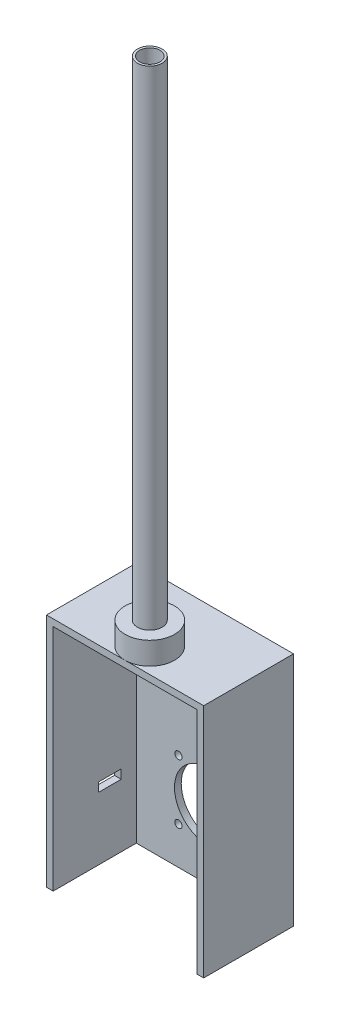
ISO-10303-21;
HEADER;
FILE_DESCRIPTION(('STEP AP214'),'2;1');
FILE_NAME('part.step','',(''),(''),'','','');
FILE_SCHEMA(('AUTOMOTIVE_DESIGN { 1 0 10303 214 1 1 1 1 }'));
ENDSEC;
DATA;
#1=APPLICATION_CONTEXT('core data for automotive mechanical design processes');
#2=APPLICATION_PROTOCOL_DEFINITION('international standard','automotive_design',2000,#1);
#3=PRODUCT_CONTEXT('',#1,'mechanical');
#4=PRODUCT('Part','Part','',(#3));
#5=PRODUCT_RELATED_PRODUCT_CATEGORY('part','',(#4));
#6=PRODUCT_DEFINITION_FORMATION('','',#4);
#7=PRODUCT_DEFINITION_CONTEXT('part definition',#1,'design');
#8=PRODUCT_DEFINITION('design','',#6,#7);
#9=PRODUCT_DEFINITION_SHAPE('','',#8);
#10=(LENGTH_UNIT() NAMED_UNIT(*) SI_UNIT(.MILLI.,.METRE.));
#11=(NAMED_UNIT(*) PLANE_ANGLE_UNIT() SI_UNIT($,.RADIAN.));
#12=(NAMED_UNIT(*) SI_UNIT($,.STERADIAN.) SOLID_ANGLE_UNIT());
#13=UNCERTAINTY_MEASURE_WITH_UNIT(LENGTH_MEASURE(1.E-05),#10,'distance_accuracy_value','');
#14=(GEOMETRIC_REPRESENTATION_CONTEXT(3) GLOBAL_UNCERTAINTY_ASSIGNED_CONTEXT((#13)) GLOBAL_UNIT_ASSIGNED_CONTEXT((#10,
#11,#12)) REPRESENTATION_CONTEXT('',''));
#15=CARTESIAN_POINT('',(0.,0.,0.));
#16=DIRECTION('',(0.,0.,1.));
#17=DIRECTION('',(1.,0.,0.));
#18=AXIS2_PLACEMENT_3D('',#15,#16,#17);
#19=CARTESIAN_POINT('',(-70.,-210.,22.));
#20=DIRECTION('',(0.,0.,-1.));
#21=DIRECTION('',(-1.,0.,0.));
#22=AXIS2_PLACEMENT_3D('',#19,#20,#21);
#23=PLANE('',#22);
#24=DIRECTION('',(0.,1.,0.));
#25=VECTOR('',#24,1.);
#26=CARTESIAN_POINT('',(64.,-210.,22.));
#27=LINE('',#26,#25);
#28=CARTESIAN_POINT('',(64.,-210.,22.));
#29=VERTEX_POINT('',#28);
#30=CARTESIAN_POINT('',(64.,-6.,22.));
#31=VERTEX_POINT('',#30);
#32=EDGE_CURVE('E210',#29,#31,#27,.T.);
#33=ORIENTED_EDGE('',*,*,#32,.F.);
#34=DIRECTION('',(-1.,0.,0.));
#35=VECTOR('',#34,1.);
#36=CARTESIAN_POINT('',(-70.,-210.,22.));
#37=LINE('',#36,#35);
#38=CARTESIAN_POINT('',(70.,-210.,22.));
#39=VERTEX_POINT('',#38);
#40=EDGE_CURVE('E221',#39,#29,#37,.T.);
#41=ORIENTED_EDGE('',*,*,#40,.F.);
#42=DIRECTION('',(0.,1.,0.));
#43=VECTOR('',#42,1.);
#44=CARTESIAN_POINT('',(70.,-210.,22.));
#45=LINE('',#44,#43);
#46=CARTESIAN_POINT('',(70.,0.,22.));
#47=VERTEX_POINT('',#46);
#48=EDGE_CURVE('E244',#39,#47,#45,.T.);
#49=ORIENTED_EDGE('',*,*,#48,.T.);
#50=DIRECTION('',(-1.,0.,0.));
#51=VECTOR('',#50,1.);
#52=CARTESIAN_POINT('',(-70.,0.,22.));
#53=LINE('',#52,#51);
#54=CARTESIAN_POINT('',(-70.,0.,22.));
#55=VERTEX_POINT('',#54);
#56=EDGE_CURVE('E231',#47,#55,#53,.T.);
#57=ORIENTED_EDGE('',*,*,#56,.T.);
#58=DIRECTION('',(0.,1.,0.));
#59=VECTOR('',#58,1.);
#60=CARTESIAN_POINT('',(-70.,-210.,22.));
#61=LINE('',#60,#59);
#62=CARTESIAN_POINT('',(-70.,-210.,22.));
#63=VERTEX_POINT('',#62);
#64=EDGE_CURVE('E241',#63,#55,#61,.T.);
#65=ORIENTED_EDGE('',*,*,#64,.F.);
#66=CARTESIAN_POINT('',(-64.,-210.,22.));
#67=VERTEX_POINT('',#66);
#68=EDGE_CURVE('E219',#67,#63,#37,.T.);
#69=ORIENTED_EDGE('',*,*,#68,.F.);
#70=DIRECTION('',(0.,1.,0.));
#71=VECTOR('',#70,1.);
#72=CARTESIAN_POINT('',(-64.,-210.,22.));
#73=LINE('',#72,#71);
#74=CARTESIAN_POINT('',(-64.,-6.,22.));
#75=VERTEX_POINT('',#74);
#76=EDGE_CURVE('E208',#67,#75,#73,.T.);
#77=ORIENTED_EDGE('',*,*,#76,.T.);
#78=DIRECTION('',(-1.,0.,0.));
#79=VECTOR('',#78,1.);
#80=CARTESIAN_POINT('',(-70.,-6.00000000000001,22.));
#81=LINE('',#80,#79);
#82=EDGE_CURVE('E198',#31,#75,#81,.T.);
#83=ORIENTED_EDGE('',*,*,#82,.F.);
#84=EDGE_LOOP('',(#33,#41,#49,#57,#65,#69,#77,#83));
#85=FACE_BOUND('',#84,.T.);
#86=ADVANCED_FACE('F46',(#85),#23,.F.);
#87=CARTESIAN_POINT('',(70.,-210.,22.));
#88=DIRECTION('',(-1.,0.,0.));
#89=DIRECTION('',(0.,0.,1.));
#90=AXIS2_PLACEMENT_3D('',#87,#88,#89);
#91=PLANE('',#90);
#92=DIRECTION('',(0.,0.,1.));
#93=VECTOR('',#92,1.);
#94=CARTESIAN_POINT('',(70.,0.,22.));
#95=LINE('',#94,#93);
#96=CARTESIAN_POINT('',(70.,0.,-58.));
#97=VERTEX_POINT('',#96);
#98=EDGE_CURVE('E212',#97,#47,#95,.T.);
#99=ORIENTED_EDGE('',*,*,#98,.T.);
#100=ORIENTED_EDGE('',*,*,#48,.F.);
#101=DIRECTION('',(0.,0.,1.));
#102=VECTOR('',#101,1.);
#103=CARTESIAN_POINT('',(70.,-210.,22.));
#104=LINE('',#103,#102);
#105=CARTESIAN_POINT('',(70.,-210.,-58.));
#106=VERTEX_POINT('',#105);
#107=EDGE_CURVE('E216',#106,#39,#104,.T.);
#108=ORIENTED_EDGE('',*,*,#107,.F.);
#109=DIRECTION('',(0.,1.,0.));
#110=VECTOR('',#109,1.);
#111=CARTESIAN_POINT('',(70.,-210.,-58.));
#112=LINE('',#111,#110);
#113=EDGE_CURVE('E228',#106,#97,#112,.T.);
#114=ORIENTED_EDGE('',*,*,#113,.T.);
#115=EDGE_LOOP('',(#99,#100,#108,#114));
#116=FACE_BOUND('',#115,.T.);
#117=ADVANCED_FACE('F48',(#116),#91,.F.);
#118=CARTESIAN_POINT('',(-70.,-210.,22.));
#119=DIRECTION('',(1.,0.,0.));
#120=DIRECTION('',(0.,0.,-1.));
#121=AXIS2_PLACEMENT_3D('',#118,#119,#120);
#122=PLANE('',#121);
#123=DIRECTION('',(0.,0.,1.));
#124=VECTOR('',#123,1.);
#125=CARTESIAN_POINT('',(-70.,-154.,-18.5));
#126=LINE('',#125,#124);
#127=CARTESIAN_POINT('',(-70.,-154.,-38.5));
#128=VERTEX_POINT('',#127);
#129=CARTESIAN_POINT('',(-70.,-154.,-18.5));
#130=VERTEX_POINT('',#129);
#131=EDGE_CURVE('E146',#128,#130,#126,.T.);
#132=ORIENTED_EDGE('',*,*,#131,.F.);
#133=DIRECTION('',(0.,-1.,0.));
#134=VECTOR('',#133,1.);
#135=CARTESIAN_POINT('',(-70.,-146.,-38.5));
#136=LINE('',#135,#134);
#137=CARTESIAN_POINT('',(-70.,-146.,-38.5));
#138=VERTEX_POINT('',#137);
#139=EDGE_CURVE('E61',#138,#128,#136,.T.);
#140=ORIENTED_EDGE('',*,*,#139,.F.);
#141=DIRECTION('',(0.,0.,-1.));
#142=VECTOR('',#141,1.);
#143=CARTESIAN_POINT('',(-70.,-146.,-18.5));
#144=LINE('',#143,#142);
#145=CARTESIAN_POINT('',(-70.,-146.,-18.5));
#146=VERTEX_POINT('',#145);
#147=EDGE_CURVE('E153',#146,#138,#144,.T.);
#148=ORIENTED_EDGE('',*,*,#147,.F.);
#149=DIRECTION('',(0.,1.,0.));
#150=VECTOR('',#149,1.);
#151=CARTESIAN_POINT('',(-70.,-146.,-18.5));
#152=LINE('',#151,#150);
#153=EDGE_CURVE('E137',#130,#146,#152,.T.);
#154=ORIENTED_EDGE('',*,*,#153,.F.);
#155=EDGE_LOOP('',(#132,#140,#148,#154));
#156=FACE_BOUND('',#155,.T.);
#157=DIRECTION('',(0.,0.,-1.));
#158=VECTOR('',#157,1.);
#159=CARTESIAN_POINT('',(-70.,0.,22.));
#160=LINE('',#159,#158);
#161=CARTESIAN_POINT('',(-70.,0.,-58.));
#162=VERTEX_POINT('',#161);
#163=EDGE_CURVE('E233',#55,#162,#160,.T.);
#164=ORIENTED_EDGE('',*,*,#163,.T.);
#165=DIRECTION('',(0.,1.,0.));
#166=VECTOR('',#165,1.);
#167=CARTESIAN_POINT('',(-70.,-210.,-58.));
#168=LINE('',#167,#166);
#169=CARTESIAN_POINT('',(-70.,-210.,-58.));
#170=VERTEX_POINT('',#169);
#171=EDGE_CURVE('E238',#170,#162,#168,.T.);
#172=ORIENTED_EDGE('',*,*,#171,.F.);
#173=DIRECTION('',(0.,0.,-1.));
#174=VECTOR('',#173,1.);
#175=CARTESIAN_POINT('',(-70.,-210.,22.));
#176=LINE('',#175,#174);
#177=EDGE_CURVE('E224',#63,#170,#176,.T.);
#178=ORIENTED_EDGE('',*,*,#177,.F.);
#179=ORIENTED_EDGE('',*,*,#64,.T.);
#180=EDGE_LOOP('',(#164,#172,#178,#179));
#181=FACE_BOUND('',#180,.T.);
#182=ADVANCED_FACE('F150',(#156,#181),#122,.F.);
#183=CARTESIAN_POINT('',(-70.,-210.,-58.));
#184=DIRECTION('',(0.,0.,1.));
#185=DIRECTION('',(1.,0.,0.));
#186=AXIS2_PLACEMENT_3D('',#183,#184,#185);
#187=PLANE('',#186);
#188=CARTESIAN_POINT('',(-26.5165042944956,-123.483495705505,-58.));
#189=DIRECTION('',(0.,0.,-1.));
#190=DIRECTION('',(-1.,0.,0.));
#191=AXIS2_PLACEMENT_3D('',#188,#189,#190);
#192=CIRCLE('',#191,3.24999999999998);
#193=CARTESIAN_POINT('',(-29.7665042944956,-123.483495705505,-58.));
#194=VERTEX_POINT('',#193);
#195=EDGE_CURVE('E169',#194,#194,#192,.T.);
#196=ORIENTED_EDGE('',*,*,#195,.F.);
#197=EDGE_LOOP('',(#196));
#198=FACE_BOUND('',#197,.T.);
#199=CARTESIAN_POINT('',(-26.5165042944969,-176.516504294496,-58.));
#200=DIRECTION('',(0.,0.,-1.));
#201=DIRECTION('',(-1.,0.,0.));
#202=AXIS2_PLACEMENT_3D('',#199,#200,#201);
#203=CIRCLE('',#202,3.25000000000001);
#204=CARTESIAN_POINT('',(-29.7665042944969,-176.516504294496,-58.));
#205=VERTEX_POINT('',#204);
#206=EDGE_CURVE('E173',#205,#205,#203,.T.);
#207=ORIENTED_EDGE('',*,*,#206,.F.);
#208=EDGE_LOOP('',(#207));
#209=FACE_BOUND('',#208,.T.);
#210=CARTESIAN_POINT('',(26.5165042944943,-176.516504294497,-58.));
#211=DIRECTION('',(0.,0.,-1.));
#212=DIRECTION('',(-1.,0.,0.));
#213=AXIS2_PLACEMENT_3D('',#210,#211,#212);
#214=CIRCLE('',#213,3.25);
#215=CARTESIAN_POINT('',(23.2665042944943,-176.516504294497,-58.));
#216=VERTEX_POINT('',#215);
#217=EDGE_CURVE('E176',#216,#216,#214,.T.);
#218=ORIENTED_EDGE('',*,*,#217,.F.);
#219=EDGE_LOOP('',(#218));
#220=FACE_BOUND('',#219,.T.);
#221=CARTESIAN_POINT('',(26.5165042944952,-123.483495705506,-58.));
#222=DIRECTION('',(0.,0.,-1.));
#223=DIRECTION('',(-1.,0.,0.));
#224=AXIS2_PLACEMENT_3D('',#221,#222,#223);
#225=CIRCLE('',#224,3.25);
#226=CARTESIAN_POINT('',(23.2665042944952,-123.483495705506,-58.));
#227=VERTEX_POINT('',#226);
#228=EDGE_CURVE('E168',#227,#227,#225,.T.);
#229=ORIENTED_EDGE('',*,*,#228,.F.);
#230=EDGE_LOOP('',(#229));
#231=FACE_BOUND('',#230,.T.);
#232=CARTESIAN_POINT('',(0.,-150.,-58.));
#233=DIRECTION('',(0.,0.,-1.));
#234=DIRECTION('',(-1.,0.,0.));
#235=AXIS2_PLACEMENT_3D('',#232,#233,#234);
#236=CIRCLE('',#235,30.);
#237=CARTESIAN_POINT('',(-30.,-150.,-58.));
#238=VERTEX_POINT('',#237);
#239=EDGE_CURVE('E181',#238,#238,#236,.T.);
#240=ORIENTED_EDGE('',*,*,#239,.F.);
#241=EDGE_LOOP('',(#240));
#242=FACE_BOUND('',#241,.T.);
#243=DIRECTION('',(1.,0.,0.));
#244=VECTOR('',#243,1.);
#245=CARTESIAN_POINT('',(-70.,0.,-58.));
#246=LINE('',#245,#244);
#247=EDGE_CURVE('E220',#162,#97,#246,.T.);
#248=ORIENTED_EDGE('',*,*,#247,.T.);
#249=ORIENTED_EDGE('',*,*,#113,.F.);
#250=DIRECTION('',(1.,0.,0.));
#251=VECTOR('',#250,1.);
#252=CARTESIAN_POINT('',(-70.,-210.,-58.));
#253=LINE('',#252,#251);
#254=EDGE_CURVE('E226',#170,#106,#253,.T.);
#255=ORIENTED_EDGE('',*,*,#254,.F.);
#256=ORIENTED_EDGE('',*,*,#171,.T.);
#257=EDGE_LOOP('',(#248,#249,#255,#256));
#258=FACE_BOUND('',#257,.T.);
#259=ADVANCED_FACE('F291',(#198,#209,#220,#231,#242,#258),#187,.F.);
#260=CARTESIAN_POINT('',(0.,-210.,0.));
#261=DIRECTION('',(0.,-1.,0.));
#262=DIRECTION('',(0.,0.,-1.));
#263=AXIS2_PLACEMENT_3D('',#260,#261,#262);
#264=PLANE('',#263);
#265=DIRECTION('',(0.,0.,1.));
#266=VECTOR('',#265,1.);
#267=CARTESIAN_POINT('',(64.,-210.,-180.140547837131));
#268=LINE('',#267,#266);
#269=CARTESIAN_POINT('',(64.,-210.,-52.));
#270=VERTEX_POINT('',#269);
#271=EDGE_CURVE('E190',#270,#29,#268,.T.);
#272=ORIENTED_EDGE('',*,*,#271,.F.);
#273=DIRECTION('',(-1.,0.,0.));
#274=VECTOR('',#273,1.);
#275=CARTESIAN_POINT('',(64.,-210.,-52.));
#276=LINE('',#275,#274);
#277=CARTESIAN_POINT('',(-64.,-210.,-52.));
#278=VERTEX_POINT('',#277);
#279=EDGE_CURVE('E186',#270,#278,#276,.T.);
#280=ORIENTED_EDGE('',*,*,#279,.T.);
#281=DIRECTION('',(0.,0.,1.));
#282=VECTOR('',#281,1.);
#283=CARTESIAN_POINT('',(-64.,-210.,-180.140547837131));
#284=LINE('',#283,#282);
#285=EDGE_CURVE('E193',#278,#67,#284,.T.);
#286=ORIENTED_EDGE('',*,*,#285,.T.);
#287=ORIENTED_EDGE('',*,*,#68,.T.);
#288=ORIENTED_EDGE('',*,*,#177,.T.);
#289=ORIENTED_EDGE('',*,*,#254,.T.);
#290=ORIENTED_EDGE('',*,*,#107,.T.);
#291=ORIENTED_EDGE('',*,*,#40,.T.);
#292=EDGE_LOOP('',(#272,#280,#286,#287,#288,#289,#290,#291));
#293=FACE_BOUND('',#292,.T.);
#294=ADVANCED_FACE('F294',(#293),#264,.T.);
#295=CARTESIAN_POINT('',(0.,0.,0.));
#296=DIRECTION('',(0.,-1.,0.));
#297=DIRECTION('',(0.,0.,-1.));
#298=AXIS2_PLACEMENT_3D('',#295,#296,#297);
#299=PLANE('',#298);
#300=CARTESIAN_POINT('',(0.,0.,0.));
#301=DIRECTION('',(0.,-1.,0.));
#302=DIRECTION('',(0.,0.,-1.));
#303=AXIS2_PLACEMENT_3D('',#300,#301,#302);
#304=CIRCLE('',#303,9.);
#305=CARTESIAN_POINT('',(0.,0.,-9.));
#306=VERTEX_POINT('',#305);
#307=EDGE_CURVE('E165',#306,#306,#304,.T.);
#308=ORIENTED_EDGE('',*,*,#307,.T.);
#309=EDGE_LOOP('',(#308));
#310=FACE_BOUND('',#309,.T.);
#311=ORIENTED_EDGE('',*,*,#98,.F.);
#312=ORIENTED_EDGE('',*,*,#247,.F.);
#313=ORIENTED_EDGE('',*,*,#163,.F.);
#314=ORIENTED_EDGE('',*,*,#56,.F.);
#315=EDGE_LOOP('',(#311,#312,#313,#314));
#316=FACE_BOUND('',#315,.T.);
#317=ADVANCED_FACE('F296',(#310,#316),#299,.F.);
#318=CARTESIAN_POINT('',(64.,-210.,22.));
#319=DIRECTION('',(-1.,0.,0.));
#320=DIRECTION('',(0.,0.,1.));
#321=AXIS2_PLACEMENT_3D('',#318,#319,#320);
#322=PLANE('',#321);
#323=DIRECTION('',(0.,0.,1.));
#324=VECTOR('',#323,1.);
#325=CARTESIAN_POINT('',(64.,-6.00000000000001,22.));
#326=LINE('',#325,#324);
#327=CARTESIAN_POINT('',(64.,-6.,-52.));
#328=VERTEX_POINT('',#327);
#329=EDGE_CURVE('E189',#328,#31,#326,.T.);
#330=ORIENTED_EDGE('',*,*,#329,.F.);
#331=DIRECTION('',(0.,1.,0.));
#332=VECTOR('',#331,1.);
#333=CARTESIAN_POINT('',(64.,-210.,-52.));
#334=LINE('',#333,#332);
#335=EDGE_CURVE('E199',#270,#328,#334,.T.);
#336=ORIENTED_EDGE('',*,*,#335,.F.);
#337=ORIENTED_EDGE('',*,*,#271,.T.);
#338=ORIENTED_EDGE('',*,*,#32,.T.);
#339=EDGE_LOOP('',(#330,#336,#337,#338));
#340=FACE_BOUND('',#339,.T.);
#341=ADVANCED_FACE('F299',(#340),#322,.T.);
#342=CARTESIAN_POINT('',(-64.,-210.,22.));
#343=DIRECTION('',(1.,0.,0.));
#344=DIRECTION('',(0.,0.,-1.));
#345=AXIS2_PLACEMENT_3D('',#342,#343,#344);
#346=PLANE('',#345);
#347=DIRECTION('',(0.,1.,0.));
#348=VECTOR('',#347,1.);
#349=CARTESIAN_POINT('',(-64.,-210.,-38.5));
#350=LINE('',#349,#348);
#351=CARTESIAN_POINT('',(-64.,-154.,-38.5));
#352=VERTEX_POINT('',#351);
#353=CARTESIAN_POINT('',(-64.,-146.,-38.5));
#354=VERTEX_POINT('',#353);
#355=EDGE_CURVE('E12',#352,#354,#350,.T.);
#356=ORIENTED_EDGE('',*,*,#355,.F.);
#357=DIRECTION('',(0.,0.,-1.));
#358=VECTOR('',#357,1.);
#359=CARTESIAN_POINT('',(-64.,-154.,22.));
#360=LINE('',#359,#358);
#361=CARTESIAN_POINT('',(-64.,-154.,-18.5));
#362=VERTEX_POINT('',#361);
#363=EDGE_CURVE('E247',#362,#352,#360,.T.);
#364=ORIENTED_EDGE('',*,*,#363,.F.);
#365=DIRECTION('',(0.,-1.,0.));
#366=VECTOR('',#365,1.);
#367=CARTESIAN_POINT('',(-64.,-210.,-18.5));
#368=LINE('',#367,#366);
#369=CARTESIAN_POINT('',(-64.,-146.,-18.5));
#370=VERTEX_POINT('',#369);
#371=EDGE_CURVE('E140',#370,#362,#368,.T.);
#372=ORIENTED_EDGE('',*,*,#371,.F.);
#373=DIRECTION('',(0.,0.,1.));
#374=VECTOR('',#373,1.);
#375=CARTESIAN_POINT('',(-64.,-146.,22.));
#376=LINE('',#375,#374);
#377=EDGE_CURVE('E54',#354,#370,#376,.T.);
#378=ORIENTED_EDGE('',*,*,#377,.F.);
#379=EDGE_LOOP('',(#356,#364,#372,#378));
#380=FACE_BOUND('',#379,.T.);
#381=DIRECTION('',(0.,0.,-1.));
#382=VECTOR('',#381,1.);
#383=CARTESIAN_POINT('',(-64.,-6.00000000000001,22.));
#384=LINE('',#383,#382);
#385=CARTESIAN_POINT('',(-64.,-6.,-52.));
#386=VERTEX_POINT('',#385);
#387=EDGE_CURVE('E205',#75,#386,#384,.T.);
#388=ORIENTED_EDGE('',*,*,#387,.F.);
#389=ORIENTED_EDGE('',*,*,#76,.F.);
#390=ORIENTED_EDGE('',*,*,#285,.F.);
#391=DIRECTION('',(0.,1.,0.));
#392=VECTOR('',#391,1.);
#393=CARTESIAN_POINT('',(-64.,-210.,-52.));
#394=LINE('',#393,#392);
#395=EDGE_CURVE('E202',#278,#386,#394,.T.);
#396=ORIENTED_EDGE('',*,*,#395,.T.);
#397=EDGE_LOOP('',(#388,#389,#390,#396));
#398=FACE_BOUND('',#397,.T.);
#399=ADVANCED_FACE('F267',(#380,#398),#346,.T.);
#400=CARTESIAN_POINT('',(-70.,-210.,-52.));
#401=DIRECTION('',(0.,0.,1.));
#402=DIRECTION('',(1.,0.,0.));
#403=AXIS2_PLACEMENT_3D('',#400,#401,#402);
#404=PLANE('',#403);
#405=CARTESIAN_POINT('',(-26.5165042944956,-123.483495705505,-52.));
#406=DIRECTION('',(0.,0.,1.));
#407=DIRECTION('',(1.,0.,0.));
#408=AXIS2_PLACEMENT_3D('',#405,#406,#407);
#409=CIRCLE('',#408,3.24999999999998);
#410=CARTESIAN_POINT('',(-23.2665042944956,-123.483495705505,-52.));
#411=VERTEX_POINT('',#410);
#412=EDGE_CURVE('E185',#411,#411,#409,.T.);
#413=ORIENTED_EDGE('',*,*,#412,.F.);
#414=EDGE_LOOP('',(#413));
#415=FACE_BOUND('',#414,.T.);
#416=CARTESIAN_POINT('',(-26.5165042944969,-176.516504294496,-52.));
#417=DIRECTION('',(0.,0.,1.));
#418=DIRECTION('',(1.,0.,0.));
#419=AXIS2_PLACEMENT_3D('',#416,#417,#418);
#420=CIRCLE('',#419,3.25000000000001);
#421=CARTESIAN_POINT('',(-23.2665042944969,-176.516504294496,-52.));
#422=VERTEX_POINT('',#421);
#423=EDGE_CURVE('E255',#422,#422,#420,.T.);
#424=ORIENTED_EDGE('',*,*,#423,.F.);
#425=EDGE_LOOP('',(#424));
#426=FACE_BOUND('',#425,.T.);
#427=CARTESIAN_POINT('',(26.5165042944943,-176.516504294497,-52.));
#428=DIRECTION('',(0.,0.,1.));
#429=DIRECTION('',(1.,0.,0.));
#430=AXIS2_PLACEMENT_3D('',#427,#428,#429);
#431=CIRCLE('',#430,3.25);
#432=CARTESIAN_POINT('',(29.7665042944943,-176.516504294497,-52.));
#433=VERTEX_POINT('',#432);
#434=EDGE_CURVE('E252',#433,#433,#431,.T.);
#435=ORIENTED_EDGE('',*,*,#434,.F.);
#436=EDGE_LOOP('',(#435));
#437=FACE_BOUND('',#436,.T.);
#438=CARTESIAN_POINT('',(26.5165042944952,-123.483495705506,-52.));
#439=DIRECTION('',(0.,0.,1.));
#440=DIRECTION('',(1.,0.,0.));
#441=AXIS2_PLACEMENT_3D('',#438,#439,#440);
#442=CIRCLE('',#441,3.25);
#443=CARTESIAN_POINT('',(29.7665042944952,-123.483495705506,-52.));
#444=VERTEX_POINT('',#443);
#445=EDGE_CURVE('E172',#444,#444,#442,.T.);
#446=ORIENTED_EDGE('',*,*,#445,.F.);
#447=EDGE_LOOP('',(#446));
#448=FACE_BOUND('',#447,.T.);
#449=CARTESIAN_POINT('',(0.,-150.,-52.));
#450=DIRECTION('',(0.,0.,1.));
#451=DIRECTION('',(1.,0.,0.));
#452=AXIS2_PLACEMENT_3D('',#449,#450,#451);
#453=CIRCLE('',#452,30.);
#454=CARTESIAN_POINT('',(30.,-150.,-52.));
#455=VERTEX_POINT('',#454);
#456=EDGE_CURVE('E184',#455,#455,#453,.T.);
#457=ORIENTED_EDGE('',*,*,#456,.F.);
#458=EDGE_LOOP('',(#457));
#459=FACE_BOUND('',#458,.T.);
#460=DIRECTION('',(1.,0.,0.));
#461=VECTOR('',#460,1.);
#462=CARTESIAN_POINT('',(-70.,-6.00000000000001,-52.));
#463=LINE('',#462,#461);
#464=EDGE_CURVE('E203',#386,#328,#463,.T.);
#465=ORIENTED_EDGE('',*,*,#464,.F.);
#466=ORIENTED_EDGE('',*,*,#395,.F.);
#467=ORIENTED_EDGE('',*,*,#279,.F.);
#468=ORIENTED_EDGE('',*,*,#335,.T.);
#469=EDGE_LOOP('',(#465,#466,#467,#468));
#470=FACE_BOUND('',#469,.T.);
#471=ADVANCED_FACE('F308',(#415,#426,#437,#448,#459,#470),#404,.T.);
#472=CARTESIAN_POINT('',(0.,-6.,0.));
#473=DIRECTION('',(0.,-1.,0.));
#474=DIRECTION('',(0.,0.,-1.));
#475=AXIS2_PLACEMENT_3D('',#472,#473,#474);
#476=PLANE('',#475);
#477=CARTESIAN_POINT('',(0.,-6.,0.));
#478=DIRECTION('',(0.,-1.,0.));
#479=DIRECTION('',(0.,0.,-1.));
#480=AXIS2_PLACEMENT_3D('',#477,#478,#479);
#481=CIRCLE('',#480,9.);
#482=CARTESIAN_POINT('',(0.,-6.,-9.));
#483=VERTEX_POINT('',#482);
#484=EDGE_CURVE('E160',#483,#483,#481,.T.);
#485=ORIENTED_EDGE('',*,*,#484,.F.);
#486=EDGE_LOOP('',(#485));
#487=FACE_BOUND('',#486,.T.);
#488=ORIENTED_EDGE('',*,*,#329,.T.);
#489=ORIENTED_EDGE('',*,*,#82,.T.);
#490=ORIENTED_EDGE('',*,*,#387,.T.);
#491=ORIENTED_EDGE('',*,*,#464,.T.);
#492=EDGE_LOOP('',(#488,#489,#490,#491));
#493=FACE_BOUND('',#492,.T.);
#494=ADVANCED_FACE('F304',(#487,#493),#476,.T.);
#495=CARTESIAN_POINT('',(0.,-150.,-48.));
#496=DIRECTION('',(0.,0.,-1.));
#497=DIRECTION('',(-1.,0.,0.));
#498=AXIS2_PLACEMENT_3D('',#495,#496,#497);
#499=CYLINDRICAL_SURFACE('',#498,30.);
#500=ORIENTED_EDGE('',*,*,#456,.T.);
#501=EDGE_LOOP('',(#500));
#502=FACE_BOUND('',#501,.T.);
#503=ORIENTED_EDGE('',*,*,#239,.T.);
#504=EDGE_LOOP('',(#503));
#505=FACE_BOUND('',#504,.T.);
#506=ADVANCED_FACE('F307',(#502,#505),#499,.F.);
#507=CARTESIAN_POINT('',(26.5165042944952,-123.483495705506,-48.));
#508=DIRECTION('',(0.,0.,-1.));
#509=DIRECTION('',(-1.,0.,0.));
#510=AXIS2_PLACEMENT_3D('',#507,#508,#509);
#511=CYLINDRICAL_SURFACE('',#510,3.25);
#512=ORIENTED_EDGE('',*,*,#445,.T.);
#513=EDGE_LOOP('',(#512));
#514=FACE_BOUND('',#513,.T.);
#515=ORIENTED_EDGE('',*,*,#228,.T.);
#516=EDGE_LOOP('',(#515));
#517=FACE_BOUND('',#516,.T.);
#518=ADVANCED_FACE('F320',(#514,#517),#511,.F.);
#519=CARTESIAN_POINT('',(26.5165042944943,-176.516504294497,-48.));
#520=DIRECTION('',(0.,0.,-1.));
#521=DIRECTION('',(-1.,0.,0.));
#522=AXIS2_PLACEMENT_3D('',#519,#520,#521);
#523=CYLINDRICAL_SURFACE('',#522,3.25);
#524=ORIENTED_EDGE('',*,*,#434,.T.);
#525=EDGE_LOOP('',(#524));
#526=FACE_BOUND('',#525,.T.);
#527=ORIENTED_EDGE('',*,*,#217,.T.);
#528=EDGE_LOOP('',(#527));
#529=FACE_BOUND('',#528,.T.);
#530=ADVANCED_FACE('F324',(#526,#529),#523,.F.);
#531=CARTESIAN_POINT('',(-26.5165042944969,-176.516504294496,-48.));
#532=DIRECTION('',(0.,0.,-1.));
#533=DIRECTION('',(-1.,0.,0.));
#534=AXIS2_PLACEMENT_3D('',#531,#532,#533);
#535=CYLINDRICAL_SURFACE('',#534,3.25000000000001);
#536=ORIENTED_EDGE('',*,*,#423,.T.);
#537=EDGE_LOOP('',(#536));
#538=FACE_BOUND('',#537,.T.);
#539=ORIENTED_EDGE('',*,*,#206,.T.);
#540=EDGE_LOOP('',(#539));
#541=FACE_BOUND('',#540,.T.);
#542=ADVANCED_FACE('F328',(#538,#541),#535,.F.);
#543=CARTESIAN_POINT('',(-26.5165042944956,-123.483495705505,-48.));
#544=DIRECTION('',(0.,0.,-1.));
#545=DIRECTION('',(-1.,0.,0.));
#546=AXIS2_PLACEMENT_3D('',#543,#544,#545);
#547=CYLINDRICAL_SURFACE('',#546,3.24999999999998);
#548=ORIENTED_EDGE('',*,*,#412,.T.);
#549=EDGE_LOOP('',(#548));
#550=FACE_BOUND('',#549,.T.);
#551=ORIENTED_EDGE('',*,*,#195,.T.);
#552=EDGE_LOOP('',(#551));
#553=FACE_BOUND('',#552,.T.);
#554=ADVANCED_FACE('F278',(#550,#553),#547,.F.);
#555=CARTESIAN_POINT('',(0.,12.,0.));
#556=DIRECTION('',(0.,-1.,0.));
#557=DIRECTION('',(0.,0.,-1.));
#558=AXIS2_PLACEMENT_3D('',#555,#556,#557);
#559=CYLINDRICAL_SURFACE('',#558,9.);
#560=ORIENTED_EDGE('',*,*,#484,.T.);
#561=EDGE_LOOP('',(#560));
#562=FACE_BOUND('',#561,.T.);
#563=ORIENTED_EDGE('',*,*,#307,.F.);
#564=EDGE_LOOP('',(#563));
#565=FACE_BOUND('',#564,.T.);
#566=ADVANCED_FACE('F271',(#562,#565),#559,.F.);
#567=CARTESIAN_POINT('',(-60.,-146.,-38.5));
#568=DIRECTION('',(0.,0.,-1.));
#569=DIRECTION('',(-1.,0.,0.));
#570=AXIS2_PLACEMENT_3D('',#567,#568,#569);
#571=PLANE('',#570);
#572=ORIENTED_EDGE('',*,*,#355,.T.);
#573=DIRECTION('',(-1.,0.,0.));
#574=VECTOR('',#573,1.);
#575=CARTESIAN_POINT('',(-60.,-146.,-38.5));
#576=LINE('',#575,#574);
#577=EDGE_CURVE('E158',#354,#138,#576,.T.);
#578=ORIENTED_EDGE('',*,*,#577,.T.);
#579=ORIENTED_EDGE('',*,*,#139,.T.);
#580=DIRECTION('',(-1.,0.,0.));
#581=VECTOR('',#580,1.);
#582=CARTESIAN_POINT('',(-60.,-154.,-38.5));
#583=LINE('',#582,#581);
#584=EDGE_CURVE('E143',#352,#128,#583,.T.);
#585=ORIENTED_EDGE('',*,*,#584,.F.);
#586=EDGE_LOOP('',(#572,#578,#579,#585));
#587=FACE_BOUND('',#586,.T.);
#588=ADVANCED_FACE('F269',(#587),#571,.F.);
#589=CARTESIAN_POINT('',(-60.,-146.,-18.5));
#590=DIRECTION('',(0.,1.,0.));
#591=DIRECTION('',(0.,0.,1.));
#592=AXIS2_PLACEMENT_3D('',#589,#590,#591);
#593=PLANE('',#592);
#594=ORIENTED_EDGE('',*,*,#377,.T.);
#595=DIRECTION('',(-1.,0.,0.));
#596=VECTOR('',#595,1.);
#597=CARTESIAN_POINT('',(-60.,-146.,-18.5));
#598=LINE('',#597,#596);
#599=EDGE_CURVE('E142',#370,#146,#598,.T.);
#600=ORIENTED_EDGE('',*,*,#599,.T.);
#601=ORIENTED_EDGE('',*,*,#147,.T.);
#602=ORIENTED_EDGE('',*,*,#577,.F.);
#603=EDGE_LOOP('',(#594,#600,#601,#602));
#604=FACE_BOUND('',#603,.T.);
#605=ADVANCED_FACE('F264',(#604),#593,.F.);
#606=CARTESIAN_POINT('',(-60.,-146.,-18.5));
#607=DIRECTION('',(0.,0.,1.));
#608=DIRECTION('',(1.,0.,0.));
#609=AXIS2_PLACEMENT_3D('',#606,#607,#608);
#610=PLANE('',#609);
#611=ORIENTED_EDGE('',*,*,#371,.T.);
#612=DIRECTION('',(-1.,0.,0.));
#613=VECTOR('',#612,1.);
#614=CARTESIAN_POINT('',(-60.,-154.,-18.5));
#615=LINE('',#614,#613);
#616=EDGE_CURVE('E69',#362,#130,#615,.T.);
#617=ORIENTED_EDGE('',*,*,#616,.T.);
#618=ORIENTED_EDGE('',*,*,#153,.T.);
#619=ORIENTED_EDGE('',*,*,#599,.F.);
#620=EDGE_LOOP('',(#611,#617,#618,#619));
#621=FACE_BOUND('',#620,.T.);
#622=ADVANCED_FACE('F134',(#621),#610,.F.);
#623=CARTESIAN_POINT('',(-60.,-154.,-18.5));
#624=DIRECTION('',(0.,-1.,0.));
#625=DIRECTION('',(0.,0.,-1.));
#626=AXIS2_PLACEMENT_3D('',#623,#624,#625);
#627=PLANE('',#626);
#628=ORIENTED_EDGE('',*,*,#363,.T.);
#629=ORIENTED_EDGE('',*,*,#584,.T.);
#630=ORIENTED_EDGE('',*,*,#131,.T.);
#631=ORIENTED_EDGE('',*,*,#616,.F.);
#632=EDGE_LOOP('',(#628,#629,#630,#631));
#633=FACE_BOUND('',#632,.T.);
#634=ADVANCED_FACE('F147',(#633),#627,.F.);
#635=CLOSED_SHELL('',(#86,#117,#182,#259,#294,#317,#341,#399,#471,#494,#506,#518,#530,#542,#554,
#566,#588,#605,#622,#634));
#636=MANIFOLD_SOLID_BREP('B2',#635);
#637=CARTESIAN_POINT('',(0.,-28.6274169979696,0.));
#638=DIRECTION('',(0.,1.,0.));
#639=DIRECTION('',(0.,0.,1.));
#640=AXIS2_PLACEMENT_3D('',#637,#638,#639);
#641=CYLINDRICAL_SURFACE('',#640,8.);
#642=CARTESIAN_POINT('',(0.,437.,0.));
#643=DIRECTION('',(0.,1.,0.));
#644=DIRECTION('',(0.,0.,1.));
#645=AXIS2_PLACEMENT_3D('',#642,#643,#644);
#646=CIRCLE('',#645,8.);
#647=CARTESIAN_POINT('',(0.,437.,8.));
#648=VERTEX_POINT('',#647);
#649=EDGE_CURVE('E532',#648,#648,#646,.F.);
#650=ORIENTED_EDGE('',*,*,#649,.F.);
#651=EDGE_LOOP('',(#650));
#652=FACE_BOUND('',#651,.T.);
#653=CARTESIAN_POINT('',(0.,12.,0.));
#654=DIRECTION('',(0.,-1.,0.));
#655=DIRECTION('',(0.,0.,-1.));
#656=AXIS2_PLACEMENT_3D('',#653,#654,#655);
#657=CIRCLE('',#656,8.);
#658=CARTESIAN_POINT('',(0.,12.,-8.));
#659=VERTEX_POINT('',#658);
#660=EDGE_CURVE('E517',#659,#659,#657,.F.);
#661=ORIENTED_EDGE('',*,*,#660,.F.);
#662=EDGE_LOOP('',(#661));
#663=FACE_BOUND('',#662,.T.);
#664=ADVANCED_FACE('F513',(#652,#663),#641,.F.);
#665=CARTESIAN_POINT('',(0.,20.,0.));
#666=DIRECTION('',(0.,-1.,0.));
#667=DIRECTION('',(0.,0.,-1.));
#668=AXIS2_PLACEMENT_3D('',#665,#666,#667);
#669=CYLINDRICAL_SURFACE('',#668,22.);
#670=CARTESIAN_POINT('',(0.,20.,0.));
#671=DIRECTION('',(0.,1.,0.));
#672=DIRECTION('',(0.,0.,1.));
#673=AXIS2_PLACEMENT_3D('',#670,#671,#672);
#674=CIRCLE('',#673,22.);
#675=CARTESIAN_POINT('',(0.,20.,22.));
#676=VERTEX_POINT('',#675);
#677=EDGE_CURVE('E45',#676,#676,#674,.T.);
#678=ORIENTED_EDGE('',*,*,#677,.F.);
#679=EDGE_LOOP('',(#678));
#680=FACE_BOUND('',#679,.T.);
#681=CARTESIAN_POINT('',(0.,0.,0.));
#682=DIRECTION('',(0.,1.,0.));
#683=DIRECTION('',(0.,0.,1.));
#684=AXIS2_PLACEMENT_3D('',#681,#682,#683);
#685=CIRCLE('',#684,22.);
#686=CARTESIAN_POINT('',(0.,0.,22.));
#687=VERTEX_POINT('',#686);
#688=EDGE_CURVE('E521',#687,#687,#685,.T.);
#689=ORIENTED_EDGE('',*,*,#688,.T.);
#690=EDGE_LOOP('',(#689));
#691=FACE_BOUND('',#690,.T.);
#692=ADVANCED_FACE('F515',(#680,#691),#669,.T.);
#693=CARTESIAN_POINT('',(0.,20.,0.));
#694=DIRECTION('',(0.,1.,0.));
#695=DIRECTION('',(0.,0.,1.));
#696=AXIS2_PLACEMENT_3D('',#693,#694,#695);
#697=PLANE('',#696);
#698=CARTESIAN_POINT('',(0.,20.,0.));
#699=DIRECTION('',(0.,1.,0.));
#700=DIRECTION('',(0.,0.,1.));
#701=AXIS2_PLACEMENT_3D('',#698,#699,#700);
#702=CIRCLE('',#701,11.);
#703=CARTESIAN_POINT('',(0.,20.,11.));
#704=VERTEX_POINT('',#703);
#705=EDGE_CURVE('E529',#704,#704,#702,.T.);
#706=ORIENTED_EDGE('',*,*,#705,.F.);
#707=EDGE_LOOP('',(#706));
#708=FACE_BOUND('',#707,.T.);
#709=ORIENTED_EDGE('',*,*,#677,.T.);
#710=EDGE_LOOP('',(#709));
#711=FACE_BOUND('',#710,.T.);
#712=ADVANCED_FACE('F558',(#708,#711),#697,.T.);
#713=CARTESIAN_POINT('',(0.,0.,0.));
#714=DIRECTION('',(0.,1.,0.));
#715=DIRECTION('',(0.,0.,1.));
#716=AXIS2_PLACEMENT_3D('',#713,#714,#715);
#717=PLANE('',#716);
#718=CARTESIAN_POINT('',(0.,0.,0.));
#719=DIRECTION('',(0.,1.,0.));
#720=DIRECTION('',(0.,0.,1.));
#721=AXIS2_PLACEMENT_3D('',#718,#719,#720);
#722=CIRCLE('',#721,9.);
#723=CARTESIAN_POINT('',(0.,0.,9.));
#724=VERTEX_POINT('',#723);
#725=EDGE_CURVE('E535',#724,#724,#722,.T.);
#726=ORIENTED_EDGE('',*,*,#725,.T.);
#727=EDGE_LOOP('',(#726));
#728=FACE_BOUND('',#727,.T.);
#729=ORIENTED_EDGE('',*,*,#688,.F.);
#730=EDGE_LOOP('',(#729));
#731=FACE_BOUND('',#730,.T.);
#732=ADVANCED_FACE('F560',(#728,#731),#717,.F.);
#733=CARTESIAN_POINT('',(0.,455.,0.));
#734=DIRECTION('',(0.,-1.,0.));
#735=DIRECTION('',(0.,0.,-1.));
#736=AXIS2_PLACEMENT_3D('',#733,#734,#735);
#737=CYLINDRICAL_SURFACE('',#736,11.);
#738=CARTESIAN_POINT('',(0.,455.,0.));
#739=DIRECTION('',(0.,1.,0.));
#740=DIRECTION('',(0.,0.,1.));
#741=AXIS2_PLACEMENT_3D('',#738,#739,#740);
#742=CIRCLE('',#741,11.);
#743=CARTESIAN_POINT('',(0.,455.,11.));
#744=VERTEX_POINT('',#743);
#745=EDGE_CURVE('E526',#744,#744,#742,.T.);
#746=ORIENTED_EDGE('',*,*,#745,.F.);
#747=EDGE_LOOP('',(#746));
#748=FACE_BOUND('',#747,.T.);
#749=ORIENTED_EDGE('',*,*,#705,.T.);
#750=EDGE_LOOP('',(#749));
#751=FACE_BOUND('',#750,.T.);
#752=ADVANCED_FACE('F556',(#748,#751),#737,.T.);
#753=CARTESIAN_POINT('',(0.,455.,0.));
#754=DIRECTION('',(0.,1.,0.));
#755=DIRECTION('',(0.,0.,1.));
#756=AXIS2_PLACEMENT_3D('',#753,#754,#755);
#757=PLANE('',#756);
#758=CARTESIAN_POINT('',(0.,455.,0.));
#759=DIRECTION('',(0.,1.,0.));
#760=DIRECTION('',(0.,0.,1.));
#761=AXIS2_PLACEMENT_3D('',#758,#759,#760);
#762=CIRCLE('',#761,9.);
#763=CARTESIAN_POINT('',(0.,455.,9.));
#764=VERTEX_POINT('',#763);
#765=EDGE_CURVE('E541',#764,#764,#762,.T.);
#766=ORIENTED_EDGE('',*,*,#765,.F.);
#767=EDGE_LOOP('',(#766));
#768=FACE_BOUND('',#767,.T.);
#769=ORIENTED_EDGE('',*,*,#745,.T.);
#770=EDGE_LOOP('',(#769));
#771=FACE_BOUND('',#770,.T.);
#772=ADVANCED_FACE('F579',(#768,#771),#757,.T.);
#773=CARTESIAN_POINT('',(0.,437.,0.));
#774=DIRECTION('',(0.,1.,0.));
#775=DIRECTION('',(0.,0.,1.));
#776=AXIS2_PLACEMENT_3D('',#773,#774,#775);
#777=PLANE('',#776);
#778=CARTESIAN_POINT('',(0.,437.,0.));
#779=DIRECTION('',(0.,1.,0.));
#780=DIRECTION('',(0.,0.,1.));
#781=AXIS2_PLACEMENT_3D('',#778,#779,#780);
#782=CIRCLE('',#781,9.);
#783=CARTESIAN_POINT('',(0.,437.,9.));
#784=VERTEX_POINT('',#783);
#785=EDGE_CURVE('E534',#784,#784,#782,.T.);
#786=ORIENTED_EDGE('',*,*,#785,.T.);
#787=EDGE_LOOP('',(#786));
#788=FACE_BOUND('',#787,.T.);
#789=ORIENTED_EDGE('',*,*,#649,.T.);
#790=EDGE_LOOP('',(#789));
#791=FACE_BOUND('',#790,.T.);
#792=ADVANCED_FACE('F581',(#788,#791),#777,.T.);
#793=CARTESIAN_POINT('',(0.,437.,0.));
#794=DIRECTION('',(0.,1.,0.));
#795=DIRECTION('',(0.,0.,1.));
#796=AXIS2_PLACEMENT_3D('',#793,#794,#795);
#797=CYLINDRICAL_SURFACE('',#796,9.);
#798=ORIENTED_EDGE('',*,*,#785,.F.);
#799=EDGE_LOOP('',(#798));
#800=FACE_BOUND('',#799,.T.);
#801=ORIENTED_EDGE('',*,*,#765,.T.);
#802=EDGE_LOOP('',(#801));
#803=FACE_BOUND('',#802,.T.);
#804=ADVANCED_FACE('F577',(#800,#803),#797,.F.);
#805=CARTESIAN_POINT('',(0.,12.,0.));
#806=DIRECTION('',(0.,-1.,0.));
#807=DIRECTION('',(0.,0.,-1.));
#808=AXIS2_PLACEMENT_3D('',#805,#806,#807);
#809=PLANE('',#808);
#810=CARTESIAN_POINT('',(0.,12.,0.));
#811=DIRECTION('',(0.,-1.,0.));
#812=DIRECTION('',(0.,0.,-1.));
#813=AXIS2_PLACEMENT_3D('',#810,#811,#812);
#814=CIRCLE('',#813,9.);
#815=CARTESIAN_POINT('',(0.,12.,-9.));
#816=VERTEX_POINT('',#815);
#817=EDGE_CURVE('E537',#816,#816,#814,.T.);
#818=ORIENTED_EDGE('',*,*,#817,.T.);
#819=EDGE_LOOP('',(#818));
#820=FACE_BOUND('',#819,.T.);
#821=ORIENTED_EDGE('',*,*,#660,.T.);
#822=EDGE_LOOP('',(#821));
#823=FACE_BOUND('',#822,.T.);
#824=ADVANCED_FACE('F605',(#820,#823),#809,.T.);
#825=CARTESIAN_POINT('',(0.,12.,0.));
#826=DIRECTION('',(0.,-1.,0.));
#827=DIRECTION('',(0.,0.,-1.));
#828=AXIS2_PLACEMENT_3D('',#825,#826,#827);
#829=CYLINDRICAL_SURFACE('',#828,9.);
#830=ORIENTED_EDGE('',*,*,#817,.F.);
#831=EDGE_LOOP('',(#830));
#832=FACE_BOUND('',#831,.T.);
#833=ORIENTED_EDGE('',*,*,#725,.F.);
#834=EDGE_LOOP('',(#833));
#835=FACE_BOUND('',#834,.T.);
#836=ADVANCED_FACE('F612',(#832,#835),#829,.F.);
#837=CLOSED_SHELL('',(#664,#692,#712,#732,#752,#772,#792,#804,#824,#836));
#838=MANIFOLD_SOLID_BREP('B6',#837);
#839=ADVANCED_BREP_SHAPE_REPRESENTATION('',(#18,#636,#838),#14);
#840=SHAPE_DEFINITION_REPRESENTATION(#9,#839);
ENDSEC;
END-ISO-10303-21;
